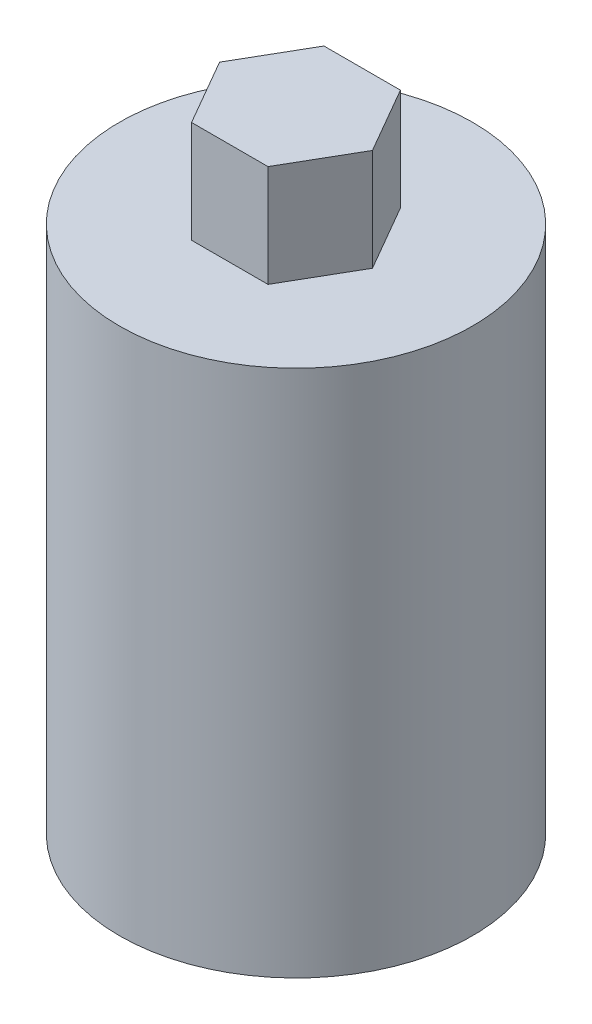
ISO-10303-21;
HEADER;
FILE_DESCRIPTION(('STEP AP214'),'2;1');
FILE_NAME('part.step','',(''),(''),'','','');
FILE_SCHEMA(('AUTOMOTIVE_DESIGN { 1 0 10303 214 1 1 1 1 }'));
ENDSEC;
DATA;
#1=APPLICATION_CONTEXT('core data for automotive mechanical design processes');
#2=APPLICATION_PROTOCOL_DEFINITION('international standard','automotive_design',2000,#1);
#3=PRODUCT_CONTEXT('',#1,'mechanical');
#4=PRODUCT('Part','Part','',(#3));
#5=PRODUCT_RELATED_PRODUCT_CATEGORY('part','',(#4));
#6=PRODUCT_DEFINITION_FORMATION('','',#4);
#7=PRODUCT_DEFINITION_CONTEXT('part definition',#1,'design');
#8=PRODUCT_DEFINITION('design','',#6,#7);
#9=PRODUCT_DEFINITION_SHAPE('','',#8);
#10=(LENGTH_UNIT() NAMED_UNIT(*) SI_UNIT(.MILLI.,.METRE.));
#11=(NAMED_UNIT(*) PLANE_ANGLE_UNIT() SI_UNIT($,.RADIAN.));
#12=(NAMED_UNIT(*) SI_UNIT($,.STERADIAN.) SOLID_ANGLE_UNIT());
#13=UNCERTAINTY_MEASURE_WITH_UNIT(LENGTH_MEASURE(1.E-05),#10,'distance_accuracy_value','');
#14=(GEOMETRIC_REPRESENTATION_CONTEXT(3) GLOBAL_UNCERTAINTY_ASSIGNED_CONTEXT((#13)) GLOBAL_UNIT_ASSIGNED_CONTEXT((#10,
#11,#12)) REPRESENTATION_CONTEXT('',''));
#15=CARTESIAN_POINT('',(0.,0.,0.));
#16=DIRECTION('',(0.,0.,1.));
#17=DIRECTION('',(1.,0.,0.));
#18=AXIS2_PLACEMENT_3D('',#15,#16,#17);
#19=CARTESIAN_POINT('',(0.,18.9925,0.));
#20=DIRECTION('',(0.,1.,0.));
#21=DIRECTION('',(0.,0.,1.));
#22=AXIS2_PLACEMENT_3D('',#19,#20,#21);
#23=PLANE('',#22);
#24=CARTESIAN_POINT('',(0.,18.9925,0.));
#25=DIRECTION('',(0.,1.,0.));
#26=DIRECTION('',(0.,0.,1.));
#27=AXIS2_PLACEMENT_3D('',#24,#25,#26);
#28=CIRCLE('',#27,6.35);
#29=CARTESIAN_POINT('',(0.,18.9925,6.35));
#30=VERTEX_POINT('',#29);
#31=EDGE_CURVE('E143',#30,#30,#28,.T.);
#32=ORIENTED_EDGE('',*,*,#31,.T.);
#33=EDGE_LOOP('',(#32));
#34=FACE_BOUND('',#33,.T.);
#35=DIRECTION('',(-0.5,0.,0.866025403784439));
#36=VECTOR('',#35,1.);
#37=CARTESIAN_POINT('',(-1.3748,18.9925,-2.38122345024569));
#38=LINE('',#37,#36);
#39=CARTESIAN_POINT('',(-1.3748,18.9925,-2.38122345024569));
#40=VERTEX_POINT('',#39);
#41=CARTESIAN_POINT('',(-2.7496,18.9925,0.));
#42=VERTEX_POINT('',#41);
#43=EDGE_CURVE('E126',#40,#42,#38,.T.);
#44=ORIENTED_EDGE('',*,*,#43,.F.);
#45=DIRECTION('',(-1.,0.,0.));
#46=VECTOR('',#45,1.);
#47=CARTESIAN_POINT('',(1.3748,18.9925,-2.38122345024569));
#48=LINE('',#47,#46);
#49=CARTESIAN_POINT('',(1.3748,18.9925,-2.38122345024569));
#50=VERTEX_POINT('',#49);
#51=EDGE_CURVE('E123',#50,#40,#48,.T.);
#52=ORIENTED_EDGE('',*,*,#51,.F.);
#53=DIRECTION('',(-0.5,0.,-0.866025403784439));
#54=VECTOR('',#53,1.);
#55=CARTESIAN_POINT('',(2.7496,18.9925,0.));
#56=LINE('',#55,#54);
#57=CARTESIAN_POINT('',(2.7496,18.9925,0.));
#58=VERTEX_POINT('',#57);
#59=EDGE_CURVE('E82',#58,#50,#56,.T.);
#60=ORIENTED_EDGE('',*,*,#59,.F.);
#61=DIRECTION('',(0.5,0.,-0.866025403784439));
#62=VECTOR('',#61,1.);
#63=CARTESIAN_POINT('',(1.3748,18.9925,2.38122345024569));
#64=LINE('',#63,#62);
#65=CARTESIAN_POINT('',(1.3748,18.9925,2.38122345024569));
#66=VERTEX_POINT('',#65);
#67=EDGE_CURVE('E131',#66,#58,#64,.T.);
#68=ORIENTED_EDGE('',*,*,#67,.F.);
#69=DIRECTION('',(1.,0.,0.));
#70=VECTOR('',#69,1.);
#71=CARTESIAN_POINT('',(-1.3748,18.9925,2.38122345024569));
#72=LINE('',#71,#70);
#73=CARTESIAN_POINT('',(-1.3748,18.9925,2.38122345024569));
#74=VERTEX_POINT('',#73);
#75=EDGE_CURVE('E112',#74,#66,#72,.T.);
#76=ORIENTED_EDGE('',*,*,#75,.F.);
#77=DIRECTION('',(0.5,0.,0.866025403784439));
#78=VECTOR('',#77,1.);
#79=CARTESIAN_POINT('',(-2.7496,18.9925,0.));
#80=LINE('',#79,#78);
#81=EDGE_CURVE('E128',#42,#74,#80,.T.);
#82=ORIENTED_EDGE('',*,*,#81,.F.);
#83=EDGE_LOOP('',(#44,#52,#60,#68,#76,#82));
#84=FACE_BOUND('',#83,.T.);
#85=ADVANCED_FACE('F33',(#34,#84),#23,.T.);
#86=CARTESIAN_POINT('',(0.,0.,0.));
#87=DIRECTION('',(0.,1.,0.));
#88=DIRECTION('',(0.,0.,1.));
#89=AXIS2_PLACEMENT_3D('',#86,#87,#88);
#90=PLANE('',#89);
#91=CARTESIAN_POINT('',(0.,0.,0.));
#92=DIRECTION('',(0.,1.,0.));
#93=DIRECTION('',(0.,0.,1.));
#94=AXIS2_PLACEMENT_3D('',#91,#92,#93);
#95=CIRCLE('',#94,6.35);
#96=CARTESIAN_POINT('',(0.,0.,6.35));
#97=VERTEX_POINT('',#96);
#98=EDGE_CURVE('E11',#97,#97,#95,.T.);
#99=ORIENTED_EDGE('',*,*,#98,.F.);
#100=EDGE_LOOP('',(#99));
#101=FACE_BOUND('',#100,.T.);
#102=CARTESIAN_POINT('',(0.,0.,0.));
#103=DIRECTION('',(0.,1.,0.));
#104=DIRECTION('',(0.,0.,1.));
#105=AXIS2_PLACEMENT_3D('',#102,#103,#104);
#106=CIRCLE('',#105,3.);
#107=CARTESIAN_POINT('',(0.,0.,3.));
#108=VERTEX_POINT('',#107);
#109=EDGE_CURVE('E47',#108,#108,#106,.T.);
#110=ORIENTED_EDGE('',*,*,#109,.T.);
#111=EDGE_LOOP('',(#110));
#112=FACE_BOUND('',#111,.T.);
#113=ADVANCED_FACE('F166',(#101,#112),#90,.F.);
#114=CARTESIAN_POINT('',(0.,12.5,0.));
#115=DIRECTION('',(0.,-1.,0.));
#116=DIRECTION('',(0.,0.,-1.));
#117=AXIS2_PLACEMENT_3D('',#114,#115,#116);
#118=CYLINDRICAL_SURFACE('',#117,6.35);
#119=CARTESIAN_POINT('',(-6.35,7.547,0.));
#120=CARTESIAN_POINT('',(-6.35000398969011,7.54699472465397,-0.130555931467962));
#121=CARTESIAN_POINT('',(-6.34593890816647,7.55762854568869,-0.261076241377739));
#122=CARTESIAN_POINT('',(-6.33012963929965,7.59970520323576,-0.518209446534913));
#123=CARTESIAN_POINT('',(-6.31838678300935,7.63114443284222,-0.644823015088655));
#124=CARTESIAN_POINT('',(-6.28848040494,7.71355488397925,-0.890396734122701));
#125=CARTESIAN_POINT('',(-6.27032947705095,7.76448781061553,-1.00937135935963));
#126=CARTESIAN_POINT('',(-6.22940932060409,7.88424235438066,-1.23707694907278));
#127=CARTESIAN_POINT('',(-6.20663881943741,7.95306890235231,-1.34580507871092));
#128=CARTESIAN_POINT('',(-6.15771932779737,8.10977722907386,-1.55465440906211));
#129=CARTESIAN_POINT('',(-6.13147296383124,8.19829958375005,-1.65427192875035));
#130=CARTESIAN_POINT('',(-6.07903240405007,8.39052684957095,-1.83765571561736));
#131=CARTESIAN_POINT('',(-6.05283822744466,8.49423657234878,-1.92141693988139));
#132=CARTESIAN_POINT('',(-6.00232668170519,8.71886613529876,-2.07395660623912));
#133=CARTESIAN_POINT('',(-5.97812365120729,8.84030243845217,-2.14201618015845));
#134=CARTESIAN_POINT('',(-5.93585432476053,9.09396161956765,-2.25652093858858));
#135=CARTESIAN_POINT('',(-5.91778550353544,9.2261800309792,-2.30297502037546));
#136=CARTESIAN_POINT('',(-5.89087364983883,9.49184636810197,-2.37094947712185));
#137=CARTESIAN_POINT('',(-5.88167580744491,9.62501069920451,-2.39343294050412));
#138=CARTESIAN_POINT('',(-5.87251090464605,9.89351540370637,-2.41583880524757));
#139=CARTESIAN_POINT('',(-5.87253989940926,10.0288548224232,-2.41577084821779));
#140=CARTESIAN_POINT('',(-5.88152011871453,10.288972227003,-2.39381090108878));
#141=CARTESIAN_POINT('',(-5.88992057372023,10.4138865225632,-2.37326609797153));
#142=CARTESIAN_POINT('',(-5.91378008823147,10.6583397049908,-2.31316652422954));
#143=CARTESIAN_POINT('',(-5.92924024008996,10.7778777568419,-2.27360881167116));
#144=CARTESIAN_POINT('',(-5.96580146890692,11.0108916152852,-2.17588364092748));
#145=CARTESIAN_POINT('',(-5.98700531598431,11.1242066148411,-2.11737290423755));
#146=CARTESIAN_POINT('',(-6.03263175509447,11.3397963992059,-1.98364217411329));
#147=CARTESIAN_POINT('',(-6.05705547794376,11.4420672822727,-1.90841630395244));
#148=CARTESIAN_POINT('',(-6.10842961274997,11.6401069423886,-1.73726689770536));
#149=CARTESIAN_POINT('',(-6.13543795015635,11.7349368826002,-1.64027173491613));
#150=CARTESIAN_POINT('',(-6.18748920351012,11.907268060564,-1.43144868882472));
#151=CARTESIAN_POINT('',(-6.2125318005324,11.9847664901782,-1.31961840653187));
#152=CARTESIAN_POINT('',(-6.25835188225341,12.1213077148728,-1.08185265975391));
#153=CARTESIAN_POINT('',(-6.27905339803369,12.1800299431097,-0.955717417234619));
#154=CARTESIAN_POINT('',(-6.31329326294077,12.2751073657523,-0.694375189035109));
#155=CARTESIAN_POINT('',(-6.32683488218724,12.3114727723643,-0.559172376611221));
#156=CARTESIAN_POINT('',(-6.3446501972992,12.3589810985772,-0.291428150212525));
#157=CARTESIAN_POINT('',(-6.34938771868047,12.37138775289,-0.159141645079808));
#158=CARTESIAN_POINT('',(-6.35049981057155,12.3743162634844,0.105693065348276));
#159=CARTESIAN_POINT('',(-6.34687629478166,12.3648431276803,0.238241203822052));
#160=CARTESIAN_POINT('',(-6.33197908606406,12.3252356238254,0.494323602805378));
#161=CARTESIAN_POINT('',(-6.32101461634214,12.2959358981882,0.618006844412109));
#162=CARTESIAN_POINT('',(-6.29285092848222,12.2186130437636,0.858609565436107));
#163=CARTESIAN_POINT('',(-6.27565090041604,12.1705874826417,0.975528163914413));
#164=CARTESIAN_POINT('',(-6.23607457125026,12.0556350371401,1.20317276582384));
#165=CARTESIAN_POINT('',(-6.21355984396609,11.9881896761049,1.3136121499673));
#166=CARTESIAN_POINT('',(-6.16583504517286,11.836895958836,1.52197988578177));
#167=CARTESIAN_POINT('',(-6.14062396176678,11.7530414346558,1.61990351002366));
#168=CARTESIAN_POINT('',(-6.08841217199752,11.5654327249606,1.80656807112922));
#169=CARTESIAN_POINT('',(-6.06139435477813,11.4607904098217,1.89441393314817));
#170=CARTESIAN_POINT('',(-6.01005496187559,11.2377280081127,2.05148411432653));
#171=CARTESIAN_POINT('',(-5.98573366426972,11.1193065031462,2.12070651399853));
#172=CARTESIAN_POINT('',(-5.94261798623815,10.8709227485386,2.23870023772464));
#173=CARTESIAN_POINT('',(-5.92385264334907,10.7409043320234,2.28736466342468));
#174=CARTESIAN_POINT('',(-5.89458517077402,10.473602694332,2.36177800946808));
#175=CARTESIAN_POINT('',(-5.8840777409413,10.3363241933636,2.38754162954713));
#176=CARTESIAN_POINT('',(-5.87323215610138,10.0681271652154,2.41408994040532));
#177=CARTESIAN_POINT('',(-5.87227054588007,9.93738426561589,2.41640623148607));
#178=CARTESIAN_POINT('',(-5.8790202253426,9.67747512660344,2.3999373204655));
#179=CARTESIAN_POINT('',(-5.88673064582665,9.54830873048875,2.38115423316032));
#180=CARTESIAN_POINT('',(-5.90943043237583,9.29944773415065,2.32422421188573));
#181=CARTESIAN_POINT('',(-5.92417751295514,9.17958208050832,2.28672002796391));
#182=CARTESIAN_POINT('',(-5.95914188552999,8.94777854381398,2.193985281894));
#183=CARTESIAN_POINT('',(-5.97936057736356,8.83584269875618,2.13875018285588));
#184=CARTESIAN_POINT('',(-6.02433337271119,8.61657199424197,2.00869997639504));
#185=CARTESIAN_POINT('',(-6.04927206356278,8.5098023758283,1.93299650808671));
#186=CARTESIAN_POINT('',(-6.10025417003155,8.30999380632774,1.76551836882646));
#187=CARTESIAN_POINT('',(-6.12629793945648,8.21695929610574,1.67373852090438));
#188=CARTESIAN_POINT('',(-6.17831294001547,8.04192790048063,1.47055494697206));
#189=CARTESIAN_POINT('',(-6.20419794006484,7.96084443358628,1.35833856072122));
#190=CARTESIAN_POINT('',(-6.25144642675378,7.81870237925231,1.12096041375387));
#191=CARTESIAN_POINT('',(-6.27280935273315,7.75764627434948,0.995797050693126));
#192=CARTESIAN_POINT('',(-6.30955475572144,7.65500736383774,0.728778395788012));
#193=CARTESIAN_POINT('',(-6.32454657619378,7.6146711947635,0.586384697783371));
#194=CARTESIAN_POINT('',(-6.34476431329028,7.56067767117735,0.295976705251578));
#195=CARTESIAN_POINT('',(-6.34999547828747,7.54700597880979,0.147965475024478));
#196=CARTESIAN_POINT('',(-6.35,7.547,0.));
#197=B_SPLINE_CURVE_WITH_KNOTS('',3,(#119,#120,#121,#122,#123,#124,#125,#126,#127,#128,#129,
#130,#131,#132,#133,#134,#135,#136,#137,#138,#139,#140,#141,#142,#143,#144,#145,#146,#147,#148,
#149,#150,#151,#152,#153,#154,#155,#156,#157,#158,#159,#160,#161,#162,#163,#164,#165,#166,#167,
#168,#169,#170,#171,#172,#173,#174,#175,#176,#177,#178,#179,#180,#181,#182,#183,#184,#185,#186,
#187,#188,#189,#190,#191,#192,#193,#194,#195,#196),.UNSPECIFIED.,.T.,.F.,(4,2,2,2,2,2,2,2,2,2,2,
2,2,2,2,2,2,2,2,2,2,2,2,2,2,2,2,2,2,2,2,2,2,2,2,2,2,2,4),(0.,0.391121887064185,
0.782175985486185,1.17246577830223,1.56286323524963,1.96854634212709,2.37435825594016,
2.79613130529395,3.21773051175688,3.62166628723491,4.02542936468621,4.40427313209371,
4.78317553819666,5.16936515238192,5.55569075901495,5.96873424705112,6.38184461005431,
6.80167192308661,7.22130732355893,7.61812936188612,8.01486058335589,8.39585156202364,
8.77689204483065,9.16923685275,9.56172942118013,9.9776135359701,10.3935404987953,
10.8116043631128,11.2293996833676,11.6197130905881,12.0099873800853,12.3876994067832,
12.7655081575183,13.1635000328781,13.5616203073396,13.9821012344605,14.4026342635628,
14.8461505355472,15.2894282569131),.UNSPECIFIED.);
#198=CARTESIAN_POINT('',(-6.35,7.547,0.));
#199=VERTEX_POINT('',#198);
#200=EDGE_CURVE('E149',#199,#199,#197,.T.);
#201=ORIENTED_EDGE('',*,*,#200,.T.);
#202=EDGE_LOOP('',(#201));
#203=FACE_BOUND('',#202,.T.);
#204=ORIENTED_EDGE('',*,*,#98,.T.);
#205=EDGE_LOOP('',(#204));
#206=FACE_BOUND('',#205,.T.);
#207=ORIENTED_EDGE('',*,*,#31,.F.);
#208=EDGE_LOOP('',(#207));
#209=FACE_BOUND('',#208,.T.);
#210=ADVANCED_FACE('F35',(#203,#206,#209),#118,.T.);
#211=CARTESIAN_POINT('',(0.,12.5,0.));
#212=DIRECTION('',(0.,-1.,0.));
#213=DIRECTION('',(0.,0.,-1.));
#214=AXIS2_PLACEMENT_3D('',#211,#212,#213);
#215=CYLINDRICAL_SURFACE('',#214,3.);
#216=CARTESIAN_POINT('',(-1.7825349926439,9.96,-2.413));
#217=CARTESIAN_POINT('',(-1.78254851108403,10.0499196821684,-2.41299430743445));
#218=CARTESIAN_POINT('',(-1.78948097817772,10.1399956725935,-2.40791485505805));
#219=CARTESIAN_POINT('',(-1.81584842282776,10.3172907054782,-2.38808345058082));
#220=CARTESIAN_POINT('',(-1.83532490097093,10.4044992509687,-2.37329938863634));
#221=CARTESIAN_POINT('',(-1.89217193978176,10.6042406339745,-2.32838878000464));
#222=CARTESIAN_POINT('',(-1.9334342456613,10.7148277307263,-2.29468610088641));
#223=CARTESIAN_POINT('',(-2.02555003805021,10.9267508882987,-2.21379961347961));
#224=CARTESIAN_POINT('',(-2.07643129450141,11.0280588708943,-2.16657656353707));
#225=CARTESIAN_POINT('',(-2.1656776874194,11.1911685246025,-2.07665948749543));
#226=CARTESIAN_POINT('',(-2.20295744482445,11.2553881633895,-2.03719773883297));
#227=CARTESIAN_POINT('',(-2.2782153354572,11.3796045594454,-1.9526757579899));
#228=CARTESIAN_POINT('',(-2.31619372064442,11.4395997539602,-1.90761347086338));
#229=CARTESIAN_POINT('',(-2.42945509221245,11.613038632424,-1.76423363773395));
#230=CARTESIAN_POINT('',(-2.50421259442698,11.7201909977501,-1.65758179162862));
#231=CARTESIAN_POINT('',(-2.63071747154032,11.8954815806143,-1.44615979012904));
#232=CARTESIAN_POINT('',(-2.68408107520286,11.9671390180312,-1.34525258253043));
#233=CARTESIAN_POINT('',(-2.78142252711401,12.0955660878208,-1.13028181937376));
#234=CARTESIAN_POINT('',(-2.82541500270635,12.1523589543913,-1.01623920198196));
#235=CARTESIAN_POINT('',(-2.89425708531859,12.2403305772352,-0.796428887883772));
#236=CARTESIAN_POINT('',(-2.92105872326036,12.2741763607273,-0.692345870978521));
#237=CARTESIAN_POINT('',(-2.96361284104196,12.3276646677534,-0.478397743977269));
#238=CARTESIAN_POINT('',(-2.97937140724517,12.3473150152537,-0.368535854846747));
#239=CARTESIAN_POINT('',(-2.99855495660367,12.3712138860379,-0.145659147012714));
#240=CARTESIAN_POINT('',(-3.0019361369989,12.3754077100494,-0.0326345542978089));
#241=CARTESIAN_POINT('',(-2.99593254359604,12.3679422367785,0.192544812149889));
#242=CARTESIAN_POINT('',(-2.98654731944803,12.3562823802387,0.304699555057344));
#243=CARTESIAN_POINT('',(-2.95672013379574,12.3189993955601,0.518470111959462));
#244=CARTESIAN_POINT('',(-2.93692762333519,12.2941958373885,0.62032424757627));
#245=CARTESIAN_POINT('',(-2.88813780009708,12.2325018070078,0.817943049723853));
#246=CARTESIAN_POINT('',(-2.85913814232632,12.1956082554885,0.913706157447717));
#247=CARTESIAN_POINT('',(-2.79056349046066,12.1072460120633,1.10643203783421));
#248=CARTESIAN_POINT('',(-2.75024496128841,12.0547247498539,1.20264250067165));
#249=CARTESIAN_POINT('',(-2.66306875686147,11.9388782512065,1.38502722464961));
#250=CARTESIAN_POINT('',(-2.61620757791065,11.8755472218905,1.47119606267212));
#251=CARTESIAN_POINT('',(-2.50819701693069,11.7254718904645,1.64983831002843));
#252=CARTESIAN_POINT('',(-2.44609539175895,11.6365933276438,1.73993915312148));
#253=CARTESIAN_POINT('',(-2.31999399168735,11.4466145520649,1.90483683136307));
#254=CARTESIAN_POINT('',(-2.25599187973017,11.3454987779427,1.97961384780714));
#255=CARTESIAN_POINT('',(-2.13648074066135,11.1404593722371,2.10771350648034));
#256=CARTESIAN_POINT('',(-2.0807100023959,11.0374860281762,2.16231111802916));
#257=CARTESIAN_POINT('',(-1.97742567724113,10.8212613225538,2.25713849785662));
#258=CARTESIAN_POINT('',(-1.92989418371491,10.7080330855337,2.29739963024274));
#259=CARTESIAN_POINT('',(-1.86347505996856,10.5085716283072,2.35131845024615));
#260=CARTESIAN_POINT('',(-1.8402788510136,10.424995003153,2.3693590896359));
#261=CARTESIAN_POINT('',(-1.80473757834436,10.2542289209517,2.39654640379945));
#262=CARTESIAN_POINT('',(-1.79236757722895,10.1670482536708,2.40571352329159));
#263=CARTESIAN_POINT('',(-1.78062290254388,9.99072665550431,2.4144253969145));
#264=CARTESIAN_POINT('',(-1.78133044051318,9.90157684499882,2.41390927736139));
#265=CARTESIAN_POINT('',(-1.79580235552103,9.72490118126826,2.40315631476085));
#266=CARTESIAN_POINT('',(-1.80958454365978,9.63737770939686,2.39290621145667));
#267=CARTESIAN_POINT('',(-1.85237990449067,9.44555326831358,2.35999209766829));
#268=CARTESIAN_POINT('',(-1.88427854935846,9.3423380143135,2.33491836229512));
#269=CARTESIAN_POINT('',(-1.95849789456295,9.14336520372433,2.27301708574988));
#270=CARTESIAN_POINT('',(-2.00084997283333,9.04763126425136,2.23615405643569));
#271=CARTESIAN_POINT('',(-2.07928185065524,8.88787636798543,2.16302478034027));
#272=CARTESIAN_POINT('',(-2.11410204292512,8.82211322265008,2.12912757853383));
#273=CARTESIAN_POINT('',(-2.18538365975819,8.69458627423353,2.05589604106465));
#274=CARTESIAN_POINT('',(-2.22184578406189,8.63282420415906,2.01655937219534));
#275=CARTESIAN_POINT('',(-2.29527172470882,8.51325680194928,1.93257336951637));
#276=CARTESIAN_POINT('',(-2.33223587161903,8.45545424512624,1.88792036819741));
#277=CARTESIAN_POINT('',(-2.40568283403059,8.3439449065483,1.79340091016876));
#278=CARTESIAN_POINT('',(-2.44216539146097,8.29024025249998,1.7435317765776));
#279=CARTESIAN_POINT('',(-2.55077221093352,8.13387522110273,1.58435087623979));
#280=CARTESIAN_POINT('',(-2.62086837226595,8.0378198954683,1.46675739675375));
#281=CARTESIAN_POINT('',(-2.71641699735606,7.91005854086316,1.27522019214263));
#282=CARTESIAN_POINT('',(-2.74664666798879,7.87021736396989,1.20890975466684));
#283=CARTESIAN_POINT('',(-2.8031223524527,7.79652362985639,1.07145509098417));
#284=CARTESIAN_POINT('',(-2.82937059507553,7.76266772033125,1.00031360171925));
#285=CARTESIAN_POINT('',(-2.88552966518416,7.69074429655716,0.827433751507296));
#286=CARTESIAN_POINT('',(-2.91341002475666,7.65547847502803,0.723829446901856));
#287=CARTESIAN_POINT('',(-2.95823010410423,7.59907044266722,0.510610596478722));
#288=CARTESIAN_POINT('',(-2.97517822369975,7.57791738781772,0.401000735477446));
#289=CARTESIAN_POINT('',(-2.99679714910096,7.55096939447728,0.178231721381844));
#290=CARTESIAN_POINT('',(-3.00141951147537,7.5452350548114,0.0650603272508403));
#291=CARTESIAN_POINT('',(-2.99781723033239,7.54971391082378,-0.160760462230471));
#292=CARTESIAN_POINT('',(-2.98959220704191,7.55992757793052,-0.273409842051131));
#293=CARTESIAN_POINT('',(-2.96188754726469,7.59453068869802,-0.488120864730355));
#294=CARTESIAN_POINT('',(-2.94309654986724,7.61805325845904,-0.590415927831322));
#295=CARTESIAN_POINT('',(-2.89615922585204,7.67731875501277,-0.789110074696383));
#296=CARTESIAN_POINT('',(-2.8680104607009,7.71306486719844,-0.885507613868451));
#297=CARTESIAN_POINT('',(-2.80127640445484,7.79886354013265,-1.07899256438706));
#298=CARTESIAN_POINT('',(-2.761992611793,7.84989543141903,-1.17539988565041));
#299=CARTESIAN_POINT('',(-2.67675205778911,7.96276728263876,-1.35838314274924));
#300=CARTESIAN_POINT('',(-2.63079213400657,8.02461236755601,-1.44495438446664));
#301=CARTESIAN_POINT('',(-2.52472950925042,8.17117308355859,-1.6244042754742));
#302=CARTESIAN_POINT('',(-2.46365045504718,8.25798252948495,-1.7149915533042));
#303=CARTESIAN_POINT('',(-2.33920868843212,8.44367441704857,-1.88119309981082));
#304=CARTESIAN_POINT('',(-2.27584293752944,8.5425733729074,-1.95678650902518));
#305=CARTESIAN_POINT('',(-2.15466171698097,8.74690186923453,-2.08927939385767));
#306=CARTESIAN_POINT('',(-2.09672580657746,8.85179074161317,-2.14690153752136));
#307=CARTESIAN_POINT('',(-1.98895460258891,9.07244862901299,-2.2470961520863));
#308=CARTESIAN_POINT('',(-1.93910405716193,9.18819649317335,-2.28969714074973));
#309=CARTESIAN_POINT('',(-1.86914556012343,9.39226904807509,-2.34684220491015));
#310=CARTESIAN_POINT('',(-1.84461479530682,9.47775566078995,-2.36599689021046));
#311=CARTESIAN_POINT('',(-1.80685786664068,9.65260564452509,-2.39496385594399));
#312=CARTESIAN_POINT('',(-1.79358820093606,9.74195268297467,-2.40481210423824));
#313=CARTESIAN_POINT('',(-1.78560159044096,9.85322076144575,-2.41073162463597));
#314=CARTESIAN_POINT('',(-1.78445472778669,9.87454763243695,-2.41158092729565));
#315=CARTESIAN_POINT('',(-1.78291975498661,9.91724671823525,-2.41271584131613));
#316=CARTESIAN_POINT('',(-1.78253177823558,9.93861894035322,-2.41300135357555));
#317=CARTESIAN_POINT('',(-1.7825349926439,9.96,-2.413));
#318=B_SPLINE_CURVE_WITH_KNOTS('',3,(#216,#217,#218,#219,#220,#221,#222,#223,#224,#225,#226,
#227,#228,#229,#230,#231,#232,#233,#234,#235,#236,#237,#238,#239,#240,#241,#242,#243,#244,#245,
#246,#247,#248,#249,#250,#251,#252,#253,#254,#255,#256,#257,#258,#259,#260,#261,#262,#263,#264,
#265,#266,#267,#268,#269,#270,#271,#272,#273,#274,#275,#276,#277,#278,#279,#280,#281,#282,#283,
#284,#285,#286,#287,#288,#289,#290,#291,#292,#293,#294,#295,#296,#297,#298,#299,#300,#301,#302,
#303,#304,#305,#306,#307,#308,#309,#310,#311,#312,#313,#314,#315,#316,#317),.UNSPECIFIED.,.T.,
.F.,(4,2,2,2,2,2,2,2,2,2,2,2,2,2,2,2,2,2,2,2,2,2,2,2,2,2,2,2,2,2,2,2,2,2,2,2,2,2,2,2,2,2,2,2,2,
2,2,2,2,2,4),(0.,0.269664563763873,0.540225900370231,0.906431428525918,1.27371080120684,
1.52568802942088,1.77775798742868,2.28092709298978,2.68379348090293,3.08602635274482,
3.42264667079347,3.75908131510788,4.09670543489132,4.43434146507116,4.75304640779462,
5.07183258754489,5.420941242829,5.77023757375612,6.19166392007547,6.61363191528355,
7.0001342552437,7.3857857673874,7.65061264135253,7.91482788767167,8.1807046766231,
8.44694418033309,8.77782272160044,9.10970679976915,9.3547263651677,9.59985135723955,
9.84514644115199,10.0905680321805,10.5889892881923,10.837797382389,11.0864656763979,
11.4237880366374,11.76085090449,12.0992365778342,12.4376322541633,12.7561737296253,
13.0747982787149,13.4213498983061,13.7680662157638,14.1852171468329,14.6029444091928,
15.0006380543956,15.3975725579911,15.6695486670438,15.9404692812302,16.0045787261475,
16.0686994390262),.UNSPECIFIED.);
#319=CARTESIAN_POINT('',(-1.7825349926439,9.96,-2.413));
#320=VERTEX_POINT('',#319);
#321=EDGE_CURVE('E38',#320,#320,#318,.T.);
#322=ORIENTED_EDGE('',*,*,#321,.F.);
#323=EDGE_LOOP('',(#322));
#324=FACE_BOUND('',#323,.T.);
#325=CARTESIAN_POINT('',(0.,12.5,0.));
#326=DIRECTION('',(0.,1.,0.));
#327=DIRECTION('',(0.,0.,1.));
#328=AXIS2_PLACEMENT_3D('',#325,#326,#327);
#329=CIRCLE('',#328,3.);
#330=CARTESIAN_POINT('',(0.,12.5,3.));
#331=VERTEX_POINT('',#330);
#332=EDGE_CURVE('E146',#331,#331,#329,.T.);
#333=ORIENTED_EDGE('',*,*,#332,.T.);
#334=EDGE_LOOP('',(#333));
#335=FACE_BOUND('',#334,.T.);
#336=ORIENTED_EDGE('',*,*,#109,.F.);
#337=EDGE_LOOP('',(#336));
#338=FACE_BOUND('',#337,.T.);
#339=ADVANCED_FACE('F159',(#324,#335,#338),#215,.F.);
#340=CARTESIAN_POINT('',(-6.35,9.96,0.));
#341=DIRECTION('',(1.,0.,0.));
#342=DIRECTION('',(0.,0.,-1.));
#343=AXIS2_PLACEMENT_3D('',#340,#341,#342);
#344=CYLINDRICAL_SURFACE('',#343,2.413);
#345=ORIENTED_EDGE('',*,*,#321,.T.);
#346=EDGE_LOOP('',(#345));
#347=FACE_BOUND('',#346,.T.);
#348=ORIENTED_EDGE('',*,*,#200,.F.);
#349=EDGE_LOOP('',(#348));
#350=FACE_BOUND('',#349,.T.);
#351=ADVANCED_FACE('F154',(#347,#350),#344,.F.);
#352=CARTESIAN_POINT('',(0.,12.5,0.));
#353=DIRECTION('',(0.,1.,0.));
#354=DIRECTION('',(0.,0.,1.));
#355=AXIS2_PLACEMENT_3D('',#352,#353,#354);
#356=PLANE('',#355);
#357=ORIENTED_EDGE('',*,*,#332,.F.);
#358=EDGE_LOOP('',(#357));
#359=FACE_BOUND('',#358,.T.);
#360=ADVANCED_FACE('F158',(#359),#356,.F.);
#361=CARTESIAN_POINT('',(1.3748,22.6625,-2.38122345024569));
#362=DIRECTION('',(0.,0.,1.));
#363=DIRECTION('',(1.,0.,0.));
#364=AXIS2_PLACEMENT_3D('',#361,#362,#363);
#365=PLANE('',#364);
#366=ORIENTED_EDGE('',*,*,#51,.T.);
#367=DIRECTION('',(0.,-1.,0.));
#368=VECTOR('',#367,1.);
#369=CARTESIAN_POINT('',(-1.3748,22.6625,-2.38122345024569));
#370=LINE('',#369,#368);
#371=CARTESIAN_POINT('',(-1.3748,22.6625,-2.38122345024569));
#372=VERTEX_POINT('',#371);
#373=EDGE_CURVE('E141',#372,#40,#370,.T.);
#374=ORIENTED_EDGE('',*,*,#373,.F.);
#375=DIRECTION('',(-1.,0.,0.));
#376=VECTOR('',#375,1.);
#377=CARTESIAN_POINT('',(1.3748,22.6625,-2.38122345024569));
#378=LINE('',#377,#376);
#379=CARTESIAN_POINT('',(1.3748,22.6625,-2.38122345024569));
#380=VERTEX_POINT('',#379);
#381=EDGE_CURVE('E134',#380,#372,#378,.T.);
#382=ORIENTED_EDGE('',*,*,#381,.F.);
#383=DIRECTION('',(0.,-1.,0.));
#384=VECTOR('',#383,1.);
#385=CARTESIAN_POINT('',(1.3748,22.6625,-2.38122345024569));
#386=LINE('',#385,#384);
#387=EDGE_CURVE('E119',#380,#50,#386,.T.);
#388=ORIENTED_EDGE('',*,*,#387,.T.);
#389=EDGE_LOOP('',(#366,#374,#382,#388));
#390=FACE_BOUND('',#389,.T.);
#391=ADVANCED_FACE('F195',(#390),#365,.F.);
#392=CARTESIAN_POINT('',(-1.3748,22.6625,-2.38122345024569));
#393=DIRECTION('',(0.866025403784439,0.,0.5));
#394=DIRECTION('',(0.5,0.,-0.866025403784439));
#395=AXIS2_PLACEMENT_3D('',#392,#393,#394);
#396=PLANE('',#395);
#397=ORIENTED_EDGE('',*,*,#43,.T.);
#398=DIRECTION('',(0.,-1.,0.));
#399=VECTOR('',#398,1.);
#400=CARTESIAN_POINT('',(-2.7496,22.6625,0.));
#401=LINE('',#400,#399);
#402=CARTESIAN_POINT('',(-2.7496,22.6625,0.));
#403=VERTEX_POINT('',#402);
#404=EDGE_CURVE('E138',#403,#42,#401,.T.);
#405=ORIENTED_EDGE('',*,*,#404,.F.);
#406=DIRECTION('',(-0.5,0.,0.866025403784439));
#407=VECTOR('',#406,1.);
#408=CARTESIAN_POINT('',(-1.3748,22.6625,-2.38122345024569));
#409=LINE('',#408,#407);
#410=EDGE_CURVE('E90',#372,#403,#409,.T.);
#411=ORIENTED_EDGE('',*,*,#410,.F.);
#412=ORIENTED_EDGE('',*,*,#373,.T.);
#413=EDGE_LOOP('',(#397,#405,#411,#412));
#414=FACE_BOUND('',#413,.T.);
#415=ADVANCED_FACE('F187',(#414),#396,.F.);
#416=CARTESIAN_POINT('',(-2.7496,22.6625,0.));
#417=DIRECTION('',(0.866025403784439,0.,-0.5));
#418=DIRECTION('',(-0.5,0.,-0.866025403784439));
#419=AXIS2_PLACEMENT_3D('',#416,#417,#418);
#420=PLANE('',#419);
#421=ORIENTED_EDGE('',*,*,#81,.T.);
#422=DIRECTION('',(0.,-1.,0.));
#423=VECTOR('',#422,1.);
#424=CARTESIAN_POINT('',(-1.3748,22.6625,2.38122345024569));
#425=LINE('',#424,#423);
#426=CARTESIAN_POINT('',(-1.3748,22.6625,2.38122345024569));
#427=VERTEX_POINT('',#426);
#428=EDGE_CURVE('E115',#427,#74,#425,.T.);
#429=ORIENTED_EDGE('',*,*,#428,.F.);
#430=DIRECTION('',(0.5,0.,0.866025403784439));
#431=VECTOR('',#430,1.);
#432=CARTESIAN_POINT('',(-2.7496,22.6625,0.));
#433=LINE('',#432,#431);
#434=EDGE_CURVE('E103',#403,#427,#433,.T.);
#435=ORIENTED_EDGE('',*,*,#434,.F.);
#436=ORIENTED_EDGE('',*,*,#404,.T.);
#437=EDGE_LOOP('',(#421,#429,#435,#436));
#438=FACE_BOUND('',#437,.T.);
#439=ADVANCED_FACE('F190',(#438),#420,.F.);
#440=CARTESIAN_POINT('',(-1.3748,22.6625,2.38122345024569));
#441=DIRECTION('',(0.,0.,-1.));
#442=DIRECTION('',(-1.,0.,0.));
#443=AXIS2_PLACEMENT_3D('',#440,#441,#442);
#444=PLANE('',#443);
#445=ORIENTED_EDGE('',*,*,#75,.T.);
#446=DIRECTION('',(0.,-1.,0.));
#447=VECTOR('',#446,1.);
#448=CARTESIAN_POINT('',(1.3748,22.6625,2.38122345024569));
#449=LINE('',#448,#447);
#450=CARTESIAN_POINT('',(1.3748,22.6625,2.38122345024569));
#451=VERTEX_POINT('',#450);
#452=EDGE_CURVE('E109',#451,#66,#449,.T.);
#453=ORIENTED_EDGE('',*,*,#452,.F.);
#454=DIRECTION('',(1.,0.,0.));
#455=VECTOR('',#454,1.);
#456=CARTESIAN_POINT('',(-1.3748,22.6625,2.38122345024569));
#457=LINE('',#456,#455);
#458=EDGE_CURVE('E97',#427,#451,#457,.T.);
#459=ORIENTED_EDGE('',*,*,#458,.F.);
#460=ORIENTED_EDGE('',*,*,#428,.T.);
#461=EDGE_LOOP('',(#445,#453,#459,#460));
#462=FACE_BOUND('',#461,.T.);
#463=ADVANCED_FACE('F110',(#462),#444,.F.);
#464=CARTESIAN_POINT('',(1.3748,22.6625,2.38122345024569));
#465=DIRECTION('',(-0.866025403784439,0.,-0.5));
#466=DIRECTION('',(-0.5,0.,0.866025403784439));
#467=AXIS2_PLACEMENT_3D('',#464,#465,#466);
#468=PLANE('',#467);
#469=ORIENTED_EDGE('',*,*,#67,.T.);
#470=DIRECTION('',(0.,-1.,0.));
#471=VECTOR('',#470,1.);
#472=CARTESIAN_POINT('',(2.7496,22.6625,0.));
#473=LINE('',#472,#471);
#474=CARTESIAN_POINT('',(2.7496,22.6625,0.));
#475=VERTEX_POINT('',#474);
#476=EDGE_CURVE('E54',#475,#58,#473,.T.);
#477=ORIENTED_EDGE('',*,*,#476,.F.);
#478=DIRECTION('',(0.5,0.,-0.866025403784439));
#479=VECTOR('',#478,1.);
#480=CARTESIAN_POINT('',(1.3748,22.6625,2.38122345024569));
#481=LINE('',#480,#479);
#482=EDGE_CURVE('E101',#451,#475,#481,.T.);
#483=ORIENTED_EDGE('',*,*,#482,.F.);
#484=ORIENTED_EDGE('',*,*,#452,.T.);
#485=EDGE_LOOP('',(#469,#477,#483,#484));
#486=FACE_BOUND('',#485,.T.);
#487=ADVANCED_FACE('F117',(#486),#468,.F.);
#488=CARTESIAN_POINT('',(2.7496,22.6625,0.));
#489=DIRECTION('',(-0.866025403784439,0.,0.5));
#490=DIRECTION('',(0.5,0.,0.866025403784439));
#491=AXIS2_PLACEMENT_3D('',#488,#489,#490);
#492=PLANE('',#491);
#493=ORIENTED_EDGE('',*,*,#59,.T.);
#494=ORIENTED_EDGE('',*,*,#387,.F.);
#495=DIRECTION('',(-0.5,0.,-0.866025403784439));
#496=VECTOR('',#495,1.);
#497=CARTESIAN_POINT('',(2.7496,22.6625,0.));
#498=LINE('',#497,#496);
#499=EDGE_CURVE('E62',#475,#380,#498,.T.);
#500=ORIENTED_EDGE('',*,*,#499,.F.);
#501=ORIENTED_EDGE('',*,*,#476,.T.);
#502=EDGE_LOOP('',(#493,#494,#500,#501));
#503=FACE_BOUND('',#502,.T.);
#504=ADVANCED_FACE('F196',(#503),#492,.F.);
#505=CARTESIAN_POINT('',(0.,22.6625,0.));
#506=DIRECTION('',(0.,1.,0.));
#507=DIRECTION('',(0.,0.,1.));
#508=AXIS2_PLACEMENT_3D('',#505,#506,#507);
#509=PLANE('',#508);
#510=ORIENTED_EDGE('',*,*,#381,.T.);
#511=ORIENTED_EDGE('',*,*,#410,.T.);
#512=ORIENTED_EDGE('',*,*,#434,.T.);
#513=ORIENTED_EDGE('',*,*,#458,.T.);
#514=ORIENTED_EDGE('',*,*,#482,.T.);
#515=ORIENTED_EDGE('',*,*,#499,.T.);
#516=EDGE_LOOP('',(#510,#511,#512,#513,#514,#515));
#517=FACE_BOUND('',#516,.T.);
#518=ADVANCED_FACE('F99',(#517),#509,.T.);
#519=CLOSED_SHELL('',(#85,#113,#210,#339,#351,#360,#391,#415,#439,#463,#487,#504,#518));
#520=MANIFOLD_SOLID_BREP('B2',#519);
#521=ADVANCED_BREP_SHAPE_REPRESENTATION('',(#18,#520),#14);
#522=SHAPE_DEFINITION_REPRESENTATION(#9,#521);
ENDSEC;
END-ISO-10303-21;
